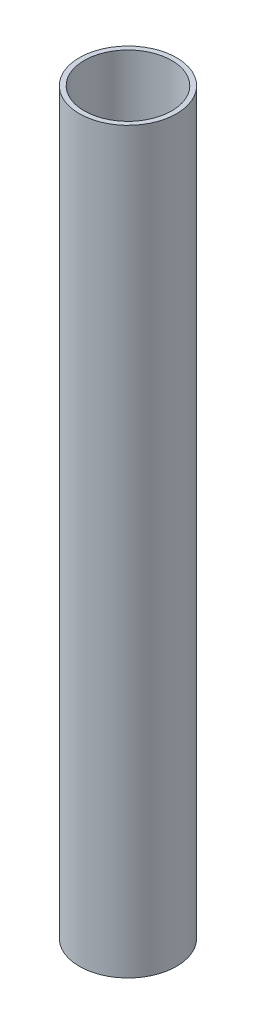
ISO-10303-21;
HEADER;
FILE_DESCRIPTION(('STEP AP214'),'2;1');
FILE_NAME('part.step','',(''),(''),'','','');
FILE_SCHEMA(('AUTOMOTIVE_DESIGN { 1 0 10303 214 1 1 1 1 }'));
ENDSEC;
DATA;
#1=APPLICATION_CONTEXT('core data for automotive mechanical design processes');
#2=APPLICATION_PROTOCOL_DEFINITION('international standard','automotive_design',2000,#1);
#3=PRODUCT_CONTEXT('',#1,'mechanical');
#4=PRODUCT('Part','Part','',(#3));
#5=PRODUCT_RELATED_PRODUCT_CATEGORY('part','',(#4));
#6=PRODUCT_DEFINITION_FORMATION('','',#4);
#7=PRODUCT_DEFINITION_CONTEXT('part definition',#1,'design');
#8=PRODUCT_DEFINITION('design','',#6,#7);
#9=PRODUCT_DEFINITION_SHAPE('','',#8);
#10=(LENGTH_UNIT() NAMED_UNIT(*) SI_UNIT(.MILLI.,.METRE.));
#11=(NAMED_UNIT(*) PLANE_ANGLE_UNIT() SI_UNIT($,.RADIAN.));
#12=(NAMED_UNIT(*) SI_UNIT($,.STERADIAN.) SOLID_ANGLE_UNIT());
#13=UNCERTAINTY_MEASURE_WITH_UNIT(LENGTH_MEASURE(1.E-05),#10,'distance_accuracy_value','');
#14=(GEOMETRIC_REPRESENTATION_CONTEXT(3) GLOBAL_UNCERTAINTY_ASSIGNED_CONTEXT((#13)) GLOBAL_UNIT_ASSIGNED_CONTEXT((#10,
#11,#12)) REPRESENTATION_CONTEXT('',''));
#15=CARTESIAN_POINT('',(0.,0.,0.));
#16=DIRECTION('',(0.,0.,1.));
#17=DIRECTION('',(1.,0.,0.));
#18=AXIS2_PLACEMENT_3D('',#15,#16,#17);
#19=CARTESIAN_POINT('',(-15.4613362043553,304.,-4.50210877873994));
#20=DIRECTION('',(0.,1.,0.));
#21=DIRECTION('',(0.,0.,1.));
#22=AXIS2_PLACEMENT_3D('',#19,#20,#21);
#23=PLANE('',#22);
#24=CARTESIAN_POINT('',(-15.4613362043553,304.,-4.50210877873994));
#25=DIRECTION('',(0.,1.,0.));
#26=DIRECTION('',(0.,0.,1.));
#27=AXIS2_PLACEMENT_3D('',#24,#25,#26);
#28=CIRCLE('',#27,20.);
#29=CARTESIAN_POINT('',(-15.4613362043553,304.,15.4978912212601));
#30=VERTEX_POINT('',#29);
#31=EDGE_CURVE('E10',#30,#30,#28,.T.);
#32=ORIENTED_EDGE('',*,*,#31,.T.);
#33=EDGE_LOOP('',(#32));
#34=FACE_BOUND('',#33,.T.);
#35=CARTESIAN_POINT('',(-15.4613362043553,304.,-4.50210877873994));
#36=DIRECTION('',(0.,1.,0.));
#37=DIRECTION('',(0.,0.,1.));
#38=AXIS2_PLACEMENT_3D('',#35,#36,#37);
#39=CIRCLE('',#38,18.);
#40=CARTESIAN_POINT('',(-15.4613362043553,304.,13.4978912212601));
#41=VERTEX_POINT('',#40);
#42=EDGE_CURVE('E43',#41,#41,#39,.T.);
#43=ORIENTED_EDGE('',*,*,#42,.F.);
#44=EDGE_LOOP('',(#43));
#45=FACE_BOUND('',#44,.T.);
#46=ADVANCED_FACE('F32',(#34,#45),#23,.T.);
#47=CARTESIAN_POINT('',(-15.4613362043553,0.,-4.50210877873994));
#48=DIRECTION('',(0.,1.,0.));
#49=DIRECTION('',(0.,0.,1.));
#50=AXIS2_PLACEMENT_3D('',#47,#48,#49);
#51=PLANE('',#50);
#52=CARTESIAN_POINT('',(-15.4613362043553,0.,-4.50210877873994));
#53=DIRECTION('',(0.,1.,0.));
#54=DIRECTION('',(0.,0.,1.));
#55=AXIS2_PLACEMENT_3D('',#52,#53,#54);
#56=CIRCLE('',#55,20.);
#57=CARTESIAN_POINT('',(-15.4613362043553,0.,15.4978912212601));
#58=VERTEX_POINT('',#57);
#59=EDGE_CURVE('E36',#58,#58,#56,.T.);
#60=ORIENTED_EDGE('',*,*,#59,.F.);
#61=EDGE_LOOP('',(#60));
#62=FACE_BOUND('',#61,.T.);
#63=CARTESIAN_POINT('',(-15.4613362043553,0.,-4.50210877873994));
#64=DIRECTION('',(0.,1.,0.));
#65=DIRECTION('',(0.,0.,1.));
#66=AXIS2_PLACEMENT_3D('',#63,#64,#65);
#67=CIRCLE('',#66,18.);
#68=CARTESIAN_POINT('',(-15.4613362043553,0.,13.4978912212601));
#69=VERTEX_POINT('',#68);
#70=EDGE_CURVE('E45',#69,#69,#67,.T.);
#71=ORIENTED_EDGE('',*,*,#70,.T.);
#72=EDGE_LOOP('',(#71));
#73=FACE_BOUND('',#72,.T.);
#74=ADVANCED_FACE('F55',(#62,#73),#51,.F.);
#75=CARTESIAN_POINT('',(-15.4613362043553,304.,-4.50210877873994));
#76=DIRECTION('',(0.,-1.,0.));
#77=DIRECTION('',(0.,0.,-1.));
#78=AXIS2_PLACEMENT_3D('',#75,#76,#77);
#79=CYLINDRICAL_SURFACE('',#78,20.);
#80=ORIENTED_EDGE('',*,*,#31,.F.);
#81=EDGE_LOOP('',(#80));
#82=FACE_BOUND('',#81,.T.);
#83=ORIENTED_EDGE('',*,*,#59,.T.);
#84=EDGE_LOOP('',(#83));
#85=FACE_BOUND('',#84,.T.);
#86=ADVANCED_FACE('F34',(#82,#85),#79,.T.);
#87=CARTESIAN_POINT('',(-15.4613362043553,304.,-4.50210877873994));
#88=DIRECTION('',(0.,-1.,0.));
#89=DIRECTION('',(0.,0.,-1.));
#90=AXIS2_PLACEMENT_3D('',#87,#88,#89);
#91=CYLINDRICAL_SURFACE('',#90,18.);
#92=ORIENTED_EDGE('',*,*,#42,.T.);
#93=EDGE_LOOP('',(#92));
#94=FACE_BOUND('',#93,.T.);
#95=ORIENTED_EDGE('',*,*,#70,.F.);
#96=EDGE_LOOP('',(#95));
#97=FACE_BOUND('',#96,.T.);
#98=ADVANCED_FACE('F51',(#94,#97),#91,.F.);
#99=CLOSED_SHELL('',(#46,#74,#86,#98));
#100=MANIFOLD_SOLID_BREP('B2',#99);
#101=ADVANCED_BREP_SHAPE_REPRESENTATION('',(#18,#100),#14);
#102=SHAPE_DEFINITION_REPRESENTATION(#9,#101);
ENDSEC;
END-ISO-10303-21;
